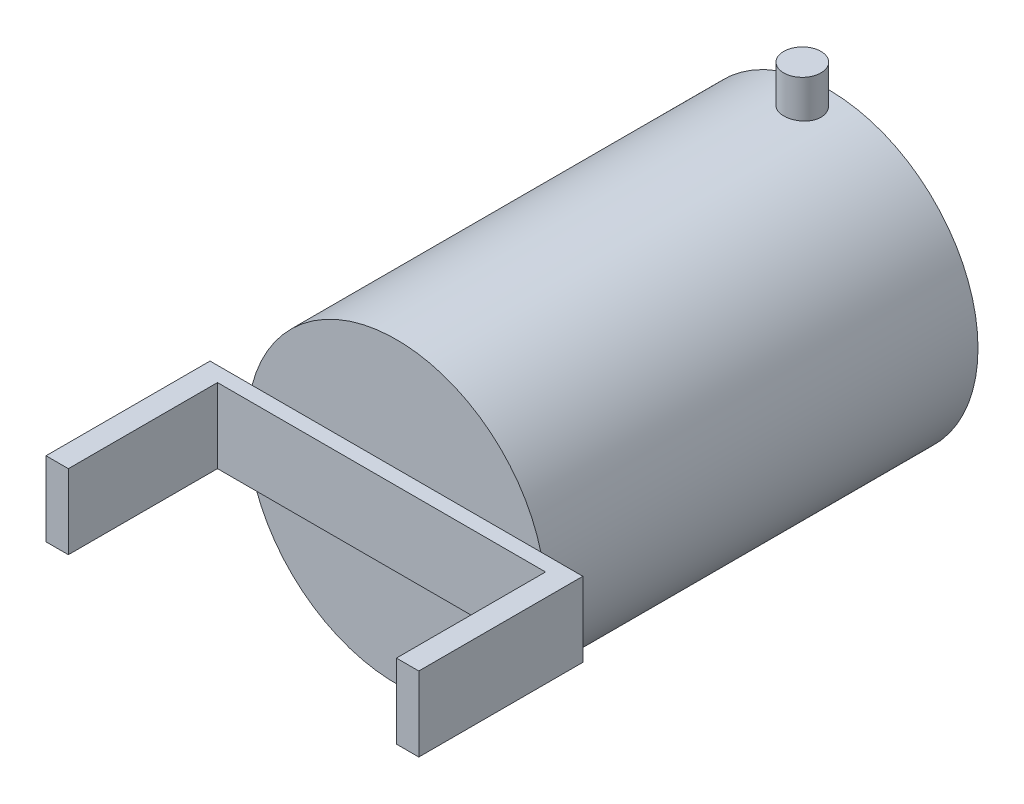
ISO-10303-21;
HEADER;
FILE_DESCRIPTION(('STEP AP214'),'2;1');
FILE_NAME('part.step','',(''),(''),'','','');
FILE_SCHEMA(('AUTOMOTIVE_DESIGN { 1 0 10303 214 1 1 1 1 }'));
ENDSEC;
DATA;
#1=APPLICATION_CONTEXT('core data for automotive mechanical design processes');
#2=APPLICATION_PROTOCOL_DEFINITION('international standard','automotive_design',2000,#1);
#3=PRODUCT_CONTEXT('',#1,'mechanical');
#4=PRODUCT('Part','Part','',(#3));
#5=PRODUCT_RELATED_PRODUCT_CATEGORY('part','',(#4));
#6=PRODUCT_DEFINITION_FORMATION('','',#4);
#7=PRODUCT_DEFINITION_CONTEXT('part definition',#1,'design');
#8=PRODUCT_DEFINITION('design','',#6,#7);
#9=PRODUCT_DEFINITION_SHAPE('','',#8);
#10=(LENGTH_UNIT() NAMED_UNIT(*) SI_UNIT(.MILLI.,.METRE.));
#11=(NAMED_UNIT(*) PLANE_ANGLE_UNIT() SI_UNIT($,.RADIAN.));
#12=(NAMED_UNIT(*) SI_UNIT($,.STERADIAN.) SOLID_ANGLE_UNIT());
#13=UNCERTAINTY_MEASURE_WITH_UNIT(LENGTH_MEASURE(1.E-05),#10,'distance_accuracy_value','');
#14=(GEOMETRIC_REPRESENTATION_CONTEXT(3) GLOBAL_UNCERTAINTY_ASSIGNED_CONTEXT((#13)) GLOBAL_UNIT_ASSIGNED_CONTEXT((#10,
#11,#12)) REPRESENTATION_CONTEXT('',''));
#15=CARTESIAN_POINT('',(0.,0.,0.));
#16=DIRECTION('',(0.,0.,1.));
#17=DIRECTION('',(1.,0.,0.));
#18=AXIS2_PLACEMENT_3D('',#15,#16,#17);
#19=CARTESIAN_POINT('',(0.,0.,60.));
#20=DIRECTION('',(0.,0.,1.));
#21=DIRECTION('',(1.,0.,0.));
#22=AXIS2_PLACEMENT_3D('',#19,#20,#21);
#23=PLANE('',#22);
#24=DIRECTION('',(1.,0.,0.));
#25=VECTOR('',#24,1.);
#26=CARTESIAN_POINT('',(-25.,-5.,60.));
#27=LINE('',#26,#25);
#28=CARTESIAN_POINT('',(-22.,-5.,60.));
#29=VERTEX_POINT('',#28);
#30=CARTESIAN_POINT('',(22.,-5.,60.));
#31=VERTEX_POINT('',#30);
#32=EDGE_CURVE('E882',#29,#31,#27,.T.);
#33=ORIENTED_EDGE('',*,*,#32,.T.);
#34=DIRECTION('',(0.,-1.,0.));
#35=VECTOR('',#34,1.);
#36=CARTESIAN_POINT('',(22.,5.,60.));
#37=LINE('',#36,#35);
#38=CARTESIAN_POINT('',(22.,5.,60.));
#39=VERTEX_POINT('',#38);
#40=EDGE_CURVE('E877',#39,#31,#37,.T.);
#41=ORIENTED_EDGE('',*,*,#40,.F.);
#42=DIRECTION('',(-1.,0.,0.));
#43=VECTOR('',#42,1.);
#44=CARTESIAN_POINT('',(-25.,5.,60.));
#45=LINE('',#44,#43);
#46=CARTESIAN_POINT('',(-22.,5.,60.));
#47=VERTEX_POINT('',#46);
#48=EDGE_CURVE('E994',#39,#47,#45,.T.);
#49=ORIENTED_EDGE('',*,*,#48,.T.);
#50=DIRECTION('',(0.,1.,0.));
#51=VECTOR('',#50,1.);
#52=CARTESIAN_POINT('',(-22.,5.,60.));
#53=LINE('',#52,#51);
#54=EDGE_CURVE('E975',#29,#47,#53,.T.);
#55=ORIENTED_EDGE('',*,*,#54,.F.);
#56=EDGE_LOOP('',(#33,#41,#49,#55));
#57=FACE_BOUND('',#56,.T.);
#58=ADVANCED_FACE('F853',(#57),#23,.T.);
#59=CARTESIAN_POINT('',(0.,0.,58.));
#60=DIRECTION('',(0.,0.,1.));
#61=DIRECTION('',(1.,0.,0.));
#62=AXIS2_PLACEMENT_3D('',#59,#60,#61);
#63=PLANE('',#62);
#64=DIRECTION('',(1.,0.,0.));
#65=VECTOR('',#64,1.);
#66=CARTESIAN_POINT('',(-25.,-5.,58.));
#67=LINE('',#66,#65);
#68=CARTESIAN_POINT('',(-19.3649167310371,-5.,58.));
#69=VERTEX_POINT('',#68);
#70=CARTESIAN_POINT('',(19.3649167310371,-5.,58.));
#71=VERTEX_POINT('',#70);
#72=EDGE_CURVE('E12',#69,#71,#67,.T.);
#73=ORIENTED_EDGE('',*,*,#72,.F.);
#74=CARTESIAN_POINT('',(0.,0.,58.));
#75=DIRECTION('',(0.,0.,1.));
#76=DIRECTION('',(1.,0.,0.));
#77=AXIS2_PLACEMENT_3D('',#74,#75,#76);
#78=CIRCLE('',#77,20.);
#79=EDGE_CURVE('E1079',#69,#71,#78,.T.);
#80=ORIENTED_EDGE('',*,*,#79,.T.);
#81=EDGE_LOOP('',(#73,#80));
#82=FACE_BOUND('',#81,.T.);
#83=ADVANCED_FACE('F1037',(#82),#63,.T.);
#84=CARTESIAN_POINT('',(0.,0.,58.));
#85=DIRECTION('',(0.,0.,-1.));
#86=DIRECTION('',(-1.,0.,0.));
#87=AXIS2_PLACEMENT_3D('',#84,#85,#86);
#88=CYLINDRICAL_SURFACE('',#87,20.);
#89=CARTESIAN_POINT('',(0.,-20.,6.06168620696042));
#90=CARTESIAN_POINT('',(0.139841095555761,-19.9999980489643,6.0616802660247));
#91=CARTESIAN_POINT('',(0.279769574302747,-19.998517845549,6.04991332779113));
#92=CARTESIAN_POINT('',(0.555732802089753,-19.9927554011136,6.00315845238962));
#93=CARTESIAN_POINT('',(0.691763330623745,-19.9884702344143,5.96814626903703));
#94=CARTESIAN_POINT('',(0.955895574813054,-19.9775806104441,5.87594856304633));
#95=CARTESIAN_POINT('',(1.08400256014614,-19.9709777145554,5.81877796515056));
#96=CARTESIAN_POINT('',(1.32877947489304,-19.956187008781,5.68391892299063));
#97=CARTESIAN_POINT('',(1.44545136155637,-19.9479994708412,5.6062339984297));
#98=CARTESIAN_POINT('',(1.66471281693132,-19.9309032130633,5.43209425712083));
#99=CARTESIAN_POINT('',(1.76723036493713,-19.9219911469242,5.33554907761418));
#100=CARTESIAN_POINT('',(1.95465279355749,-19.9044772600975,5.12662338342378));
#101=CARTESIAN_POINT('',(2.03955677639225,-19.8958754552427,5.01424206204717));
#102=CARTESIAN_POINT('',(2.18961016128394,-19.8799230561958,4.77636622939475));
#103=CARTESIAN_POINT('',(2.25469209594107,-19.8725767717791,4.65082884539248));
#104=CARTESIAN_POINT('',(2.36282307657512,-19.8600112845768,4.39049915501306));
#105=CARTESIAN_POINT('',(2.40587295806522,-19.8547920011314,4.25570719981341));
#106=CARTESIAN_POINT('',(2.46849898002476,-19.8471033960361,3.98144201137365));
#107=CARTESIAN_POINT('',(2.4881967147317,-19.8446198343674,3.84199694925622));
#108=CARTESIAN_POINT('',(2.50393554955723,-19.8426402814279,3.56175994348858));
#109=CARTESIAN_POINT('',(2.49997760100242,-19.8431441700151,3.42096805422913));
#110=CARTESIAN_POINT('',(2.4686172364479,-19.8470695536975,3.14288137971164));
#111=CARTESIAN_POINT('',(2.4413487629847,-19.8504743796033,3.00557122076015));
#112=CARTESIAN_POINT('',(2.36435038318205,-19.8597919975763,2.73749118574143));
#113=CARTESIAN_POINT('',(2.3146200217519,-19.8657048404572,2.60672144224638));
#114=CARTESIAN_POINT('',(2.19396555991165,-19.8793911586465,2.35501820793873));
#115=CARTESIAN_POINT('',(2.12298325370764,-19.8871697321144,2.23411290671143));
#116=CARTESIAN_POINT('',(1.96188146945692,-19.903707114306,2.00587951254717));
#117=CARTESIAN_POINT('',(1.87176111608078,-19.9124659678566,1.89855204098674));
#118=CARTESIAN_POINT('',(1.67419911075378,-19.9300510989042,1.69974349623768));
#119=CARTESIAN_POINT('',(1.56664200784001,-19.9388774238689,1.60837711519444));
#120=CARTESIAN_POINT('',(1.33765716911392,-19.9555463255585,1.44497732692987));
#121=CARTESIAN_POINT('',(1.21622940131825,-19.9633889000151,1.37294396428842));
#122=CARTESIAN_POINT('',(0.962861671363482,-19.9772115221858,1.2502548864965));
#123=CARTESIAN_POINT('',(0.830918195337718,-19.9831909440154,1.19960635307919));
#124=CARTESIAN_POINT('',(0.560307940431057,-19.9926078578006,1.12121571343716));
#125=CARTESIAN_POINT('',(0.421641476630668,-19.9960454687587,1.09347253482337));
#126=CARTESIAN_POINT('',(0.142513163913497,-19.9999759641076,1.06182878269987));
#127=CARTESIAN_POINT('',(0.00206949019860704,-20.0004883614264,1.05777021459635));
#128=CARTESIAN_POINT('',(-0.277496036497496,-19.9985633800543,1.07319394101637));
#129=CARTESIAN_POINT('',(-0.416617917564706,-19.9961260641821,1.09267573421201));
#130=CARTESIAN_POINT('',(-0.689124507721522,-19.9885876875669,1.1544959157348));
#131=CARTESIAN_POINT('',(-0.822526570424705,-19.9834954081387,1.19675897036305));
#132=CARTESIAN_POINT('',(-1.08034965485841,-19.971217231002,1.30286365887334));
#133=CARTESIAN_POINT('',(-1.20477037146531,-19.9640312622062,1.36670602545184));
#134=CARTESIAN_POINT('',(-1.44180452068743,-19.9483182291011,1.51453934446788));
#135=CARTESIAN_POINT('',(-1.55435375994382,-19.9397844404251,1.59863249676605));
#136=CARTESIAN_POINT('',(-1.76379698962632,-19.9223514232566,1.78443570449462));
#137=CARTESIAN_POINT('',(-1.86069035833686,-19.913452180269,1.88614645921141));
#138=CARTESIAN_POINT('',(-2.03663195881802,-19.8962310546258,2.10499362371756));
#139=CARTESIAN_POINT('',(-2.11557546056793,-19.8879127472133,2.22221455327081));
#140=CARTESIAN_POINT('',(-2.25265288944351,-19.8728541103715,2.46834445181513));
#141=CARTESIAN_POINT('',(-2.31078723372837,-19.8661137493103,2.59725318643694));
#142=CARTESIAN_POINT('',(-2.40442657886654,-19.85499850393,2.86276152610803));
#143=CARTESIAN_POINT('',(-2.43999062745711,-19.8506174518479,2.99934003700839));
#144=CARTESIAN_POINT('',(-2.48766999386785,-19.8446991590745,3.27658869074108));
#145=CARTESIAN_POINT('',(-2.49978640253576,-19.8431617860878,3.41725864291942));
#146=CARTESIAN_POINT('',(-2.50020653608484,-19.8431087698246,3.6976551361651));
#147=CARTESIAN_POINT('',(-2.48867479769927,-19.8445722475195,3.83738145529231));
#148=CARTESIAN_POINT('',(-2.44247440484933,-19.850311145372,4.1128933363055));
#149=CARTESIAN_POINT('',(-2.40780574790577,-19.8545865658308,4.24867889776921));
#150=CARTESIAN_POINT('',(-2.31636707368966,-19.8654611577455,4.51243316372682));
#151=CARTESIAN_POINT('',(-2.25960498097093,-19.8720594959278,4.64040465198223));
#152=CARTESIAN_POINT('',(-2.12560690215031,-19.8868378324482,4.88503286100873));
#153=CARTESIAN_POINT('',(-2.04837065950959,-19.8950178506041,5.00168943998025));
#154=CARTESIAN_POINT('',(-1.87500633126584,-19.9121060475223,5.22121743230089));
#155=CARTESIAN_POINT('',(-1.77875562577496,-19.9210187208403,5.3239916679154));
#156=CARTESIAN_POINT('',(-1.57035022696838,-19.938528315929,5.51199303212839));
#157=CARTESIAN_POINT('',(-1.45819178914157,-19.9471251627559,5.59721601773473));
#158=CARTESIAN_POINT('',(-1.22066562085421,-19.9630705658675,5.74797156406571));
#159=CARTESIAN_POINT('',(-1.09524927959617,-19.970414250783,5.81342801285967));
#160=CARTESIAN_POINT('',(-0.83518290230128,-19.9829764907672,5.9222574498767));
#161=CARTESIAN_POINT('',(-0.700543080870236,-19.9881973536958,5.96565443331388));
#162=CARTESIAN_POINT('',(-0.471005771967925,-19.9946672032775,6.01874554513172));
#163=CARTESIAN_POINT('',(-0.377555663516922,-19.9966572589545,6.03482514894248));
#164=CARTESIAN_POINT('',(-0.189417063212436,-19.9993243132919,6.05629745265364));
#165=CARTESIAN_POINT('',(-0.0947285804960277,-20.0000013216347,6.06169023135972));
#166=CARTESIAN_POINT('',(0.,-20.,6.06168620696042));
#167=B_SPLINE_CURVE_WITH_KNOTS('',3,(#89,#90,#91,#92,#93,#94,#95,#96,#97,#98,#99,#100,#101,#102,
#103,#104,#105,#106,#107,#108,#109,#110,#111,#112,#113,#114,#115,#116,#117,#118,#119,#120,#121,
#122,#123,#124,#125,#126,#127,#128,#129,#130,#131,#132,#133,#134,#135,#136,#137,#138,#139,#140,
#141,#142,#143,#144,#145,#146,#147,#148,#149,#150,#151,#152,#153,#154,#155,#156,#157,#158,#159,
#160,#161,#162,#163,#164,#165,#166),.UNSPECIFIED.,.T.,.F.,(4,2,2,2,2,2,2,2,2,2,2,2,2,2,2,2,2,2,
2,2,2,2,2,2,2,2,2,2,2,2,2,2,2,2,2,2,2,2,4),(0.,0.419177272776247,0.838792460943427,
1.25812550818177,1.67738665591073,2.09870813201843,2.52005107800011,2.94281250318869,
3.36555789496807,3.78609225286321,4.20660969884664,4.62472696441692,5.04285270166241,
5.46213426285534,5.88143500513639,6.30363478136417,6.72583553113114,7.14817795731605,
7.57050060903781,7.99000279391922,8.40949604501929,8.82761053893396,9.24573923078948,
9.66602402928423,10.0863255137509,10.5090197150757,10.9317054422154,11.3532807428093,
11.7748364301062,12.1934690120222,12.6121016387955,13.0305842470649,13.4490720991226,
13.8703523769183,14.2917319847001,14.7147140303685,15.1372349868403,15.4211884318763,
15.7051397830044),.UNSPECIFIED.);
#168=CARTESIAN_POINT('',(0.,-20.,6.06168620696042));
#169=VERTEX_POINT('',#168);
#170=EDGE_CURVE('E858',#169,#169,#167,.T.);
#171=ORIENTED_EDGE('',*,*,#170,.T.);
#172=EDGE_LOOP('',(#171));
#173=FACE_BOUND('',#172,.T.);
#174=CARTESIAN_POINT('',(19.3649167310371,5.,58.));
#175=VERTEX_POINT('',#174);
#176=CARTESIAN_POINT('',(-19.3649167310371,5.,58.));
#177=VERTEX_POINT('',#176);
#178=EDGE_CURVE('E1014',#175,#177,#78,.T.);
#179=ORIENTED_EDGE('',*,*,#178,.F.);
#180=EDGE_CURVE('E1018',#71,#175,#78,.T.);
#181=ORIENTED_EDGE('',*,*,#180,.F.);
#182=ORIENTED_EDGE('',*,*,#79,.F.);
#183=EDGE_CURVE('E1017',#177,#69,#78,.T.);
#184=ORIENTED_EDGE('',*,*,#183,.F.);
#185=EDGE_LOOP('',(#179,#181,#182,#184));
#186=FACE_BOUND('',#185,.T.);
#187=CARTESIAN_POINT('',(0.,0.,0.));
#188=DIRECTION('',(0.,0.,1.));
#189=DIRECTION('',(1.,0.,0.));
#190=AXIS2_PLACEMENT_3D('',#187,#188,#189);
#191=CIRCLE('',#190,20.);
#192=CARTESIAN_POINT('',(20.,0.,0.));
#193=VERTEX_POINT('',#192);
#194=EDGE_CURVE('E1013',#193,#193,#191,.T.);
#195=ORIENTED_EDGE('',*,*,#194,.T.);
#196=EDGE_LOOP('',(#195));
#197=FACE_BOUND('',#196,.T.);
#198=CARTESIAN_POINT('',(0.,20.,1.06168620696042));
#199=CARTESIAN_POINT('',(-0.139841095555761,19.9999980489643,1.06169214789614));
#200=CARTESIAN_POINT('',(-0.279769574302747,19.998517845549,1.0734590861297));
#201=CARTESIAN_POINT('',(-0.555732802089753,19.9927554011136,1.12021396153121));
#202=CARTESIAN_POINT('',(-0.691763330623745,19.9884702344143,1.15522614488381));
#203=CARTESIAN_POINT('',(-0.955895574813054,19.9775806104441,1.2474238508745));
#204=CARTESIAN_POINT('',(-1.08400256014614,19.9709777145554,1.30459444877027));
#205=CARTESIAN_POINT('',(-1.32877947489304,19.956187008781,1.43945349093021));
#206=CARTESIAN_POINT('',(-1.44545136155637,19.9479994708412,1.51713841549113));
#207=CARTESIAN_POINT('',(-1.66471281693132,19.9309032130633,1.69127815680001));
#208=CARTESIAN_POINT('',(-1.76723036493713,19.9219911469242,1.78782333630666));
#209=CARTESIAN_POINT('',(-1.95465279355749,19.9044772600975,1.99674903049706));
#210=CARTESIAN_POINT('',(-2.03955677639225,19.8958754552427,2.10913035187366));
#211=CARTESIAN_POINT('',(-2.18961016128394,19.8799230561958,2.34700618452608));
#212=CARTESIAN_POINT('',(-2.25469209594107,19.8725767717791,2.47254356852836));
#213=CARTESIAN_POINT('',(-2.36282307657512,19.8600112845768,2.73287325890778));
#214=CARTESIAN_POINT('',(-2.40587295806522,19.8547920011314,2.86766521410743));
#215=CARTESIAN_POINT('',(-2.46849898002476,19.8471033960361,3.14193040254718));
#216=CARTESIAN_POINT('',(-2.4881967147317,19.8446198343674,3.28137546466461));
#217=CARTESIAN_POINT('',(-2.50393554955723,19.8426402814279,3.56161247043225));
#218=CARTESIAN_POINT('',(-2.49997760100242,19.8431441700151,3.70240435969171));
#219=CARTESIAN_POINT('',(-2.4686172364479,19.8470695536975,3.9804910342092));
#220=CARTESIAN_POINT('',(-2.4413487629847,19.8504743796033,4.11780119316068));
#221=CARTESIAN_POINT('',(-2.36435038318205,19.8597919975763,4.3858812281794));
#222=CARTESIAN_POINT('',(-2.3146200217519,19.8657048404572,4.51665097167446));
#223=CARTESIAN_POINT('',(-2.19396555991165,19.8793911586465,4.7683542059821));
#224=CARTESIAN_POINT('',(-2.12298325370764,19.8871697321144,4.8892595072094));
#225=CARTESIAN_POINT('',(-1.96188146945692,19.903707114306,5.11749290137366));
#226=CARTESIAN_POINT('',(-1.87176111608078,19.9124659678566,5.2248203729341));
#227=CARTESIAN_POINT('',(-1.67419911075378,19.9300510989042,5.42362891768316));
#228=CARTESIAN_POINT('',(-1.56664200784001,19.9388774238689,5.5149952987264));
#229=CARTESIAN_POINT('',(-1.33765716911392,19.9555463255585,5.67839508699097));
#230=CARTESIAN_POINT('',(-1.21622940131825,19.9633889000151,5.75042844963242));
#231=CARTESIAN_POINT('',(-0.962861671363482,19.9772115221858,5.87311752742433));
#232=CARTESIAN_POINT('',(-0.830918195337717,19.9831909440154,5.92376606084165));
#233=CARTESIAN_POINT('',(-0.560307940431056,19.9926078578006,6.00215670048367));
#234=CARTESIAN_POINT('',(-0.421641476630667,19.9960454687587,6.02989987909747));
#235=CARTESIAN_POINT('',(-0.142513163913497,19.9999759641076,6.06154363122097));
#236=CARTESIAN_POINT('',(-0.00206949019860737,20.0004883614264,6.06560219932449));
#237=CARTESIAN_POINT('',(0.277496036497496,19.9985633800543,6.05017847290447));
#238=CARTESIAN_POINT('',(0.416617917564706,19.9961260641821,6.03069667970883));
#239=CARTESIAN_POINT('',(0.689124507721521,19.9885876875669,5.96887649818603));
#240=CARTESIAN_POINT('',(0.822526570424704,19.9834954081387,5.92661344355778));
#241=CARTESIAN_POINT('',(1.08034965485841,19.971217231002,5.8205087550475));
#242=CARTESIAN_POINT('',(1.20477037146531,19.9640312622062,5.75666638846899));
#243=CARTESIAN_POINT('',(1.44180452068743,19.9483182291011,5.60883306945296));
#244=CARTESIAN_POINT('',(1.55435375994382,19.9397844404251,5.52473991715478));
#245=CARTESIAN_POINT('',(1.76379698962632,19.9223514232566,5.33893670942622));
#246=CARTESIAN_POINT('',(1.86069035833686,19.913452180269,5.23722595470943));
#247=CARTESIAN_POINT('',(2.03663195881802,19.8962310546258,5.01837879020328));
#248=CARTESIAN_POINT('',(2.11557546056793,19.8879127472133,4.90115786065002));
#249=CARTESIAN_POINT('',(2.2526528894435,19.8728541103715,4.65502796210571));
#250=CARTESIAN_POINT('',(2.31078723372837,19.8661137493103,4.5261192274839));
#251=CARTESIAN_POINT('',(2.40442657886654,19.85499850393,4.26061088781281));
#252=CARTESIAN_POINT('',(2.43999062745711,19.8506174518479,4.12403237691245));
#253=CARTESIAN_POINT('',(2.48766999386785,19.8446991590745,3.84678372317975));
#254=CARTESIAN_POINT('',(2.49978640253576,19.8431617860878,3.70611377100142));
#255=CARTESIAN_POINT('',(2.50020653608484,19.8431087698246,3.42571727775574));
#256=CARTESIAN_POINT('',(2.48867479769927,19.8445722475195,3.28599095862853));
#257=CARTESIAN_POINT('',(2.44247440484933,19.850311145372,3.01047907761534));
#258=CARTESIAN_POINT('',(2.40780574790577,19.8545865658308,2.87469351615162));
#259=CARTESIAN_POINT('',(2.31636707368966,19.8654611577455,2.61093925019402));
#260=CARTESIAN_POINT('',(2.25960498097093,19.8720594959278,2.4829677619386));
#261=CARTESIAN_POINT('',(2.12560690215031,19.8868378324482,2.2383395529121));
#262=CARTESIAN_POINT('',(2.04837065950959,19.8950178506041,2.12168297394059));
#263=CARTESIAN_POINT('',(1.87500633126584,19.9121060475223,1.90215498161994));
#264=CARTESIAN_POINT('',(1.77875562577496,19.9210187208403,1.79938074600544));
#265=CARTESIAN_POINT('',(1.57035022696838,19.938528315929,1.61137938179244));
#266=CARTESIAN_POINT('',(1.45819178914157,19.9471251627559,1.52615639618611));
#267=CARTESIAN_POINT('',(1.22066562085421,19.9630705658675,1.37540084985512));
#268=CARTESIAN_POINT('',(1.09524927959617,19.970414250783,1.30994440106116));
#269=CARTESIAN_POINT('',(0.835182902301281,19.9829764907672,1.20111496404414));
#270=CARTESIAN_POINT('',(0.700543080870236,19.9881973536958,1.15771798060696));
#271=CARTESIAN_POINT('',(0.471005771967925,19.9946672032775,1.10462686878911));
#272=CARTESIAN_POINT('',(0.377555663516921,19.9966572589545,1.08854726497835));
#273=CARTESIAN_POINT('',(0.189417063212435,19.9993243132919,1.06707496126719));
#274=CARTESIAN_POINT('',(0.0947285804960273,20.0000013216347,1.06168218256112));
#275=CARTESIAN_POINT('',(0.,20.,1.06168620696042));
#276=B_SPLINE_CURVE_WITH_KNOTS('',3,(#198,#199,#200,#201,#202,#203,#204,#205,#206,#207,#208,
#209,#210,#211,#212,#213,#214,#215,#216,#217,#218,#219,#220,#221,#222,#223,#224,#225,#226,#227,
#228,#229,#230,#231,#232,#233,#234,#235,#236,#237,#238,#239,#240,#241,#242,#243,#244,#245,#246,
#247,#248,#249,#250,#251,#252,#253,#254,#255,#256,#257,#258,#259,#260,#261,#262,#263,#264,#265,
#266,#267,#268,#269,#270,#271,#272,#273,#274,#275),.UNSPECIFIED.,.T.,.F.,(4,2,2,2,2,2,2,2,2,2,2,
2,2,2,2,2,2,2,2,2,2,2,2,2,2,2,2,2,2,2,2,2,2,2,2,2,2,2,4),(0.,0.419177272776247,
0.838792460943427,1.25812550818177,1.67738665591073,2.09870813201843,2.52005107800011,
2.94281250318869,3.36555789496807,3.78609225286321,4.20660969884664,4.62472696441692,
5.04285270166241,5.46213426285534,5.88143500513639,6.30363478136417,6.72583553113114,
7.14817795731605,7.5705006090378,7.99000279391921,8.40949604501929,8.82761053893396,
9.24573923078948,9.66602402928422,10.0863255137509,10.5090197150757,10.9317054422154,
11.3532807428093,11.7748364301062,12.1934690120222,12.6121016387955,13.0305842470649,
13.4490720991226,13.8703523769183,14.2917319847001,14.7147140303685,15.1372349868403,
15.4211884318763,15.7051397830044),.UNSPECIFIED.);
#277=CARTESIAN_POINT('',(0.,20.,1.06168620696042));
#278=VERTEX_POINT('',#277);
#279=EDGE_CURVE('E1016',#278,#278,#276,.T.);
#280=ORIENTED_EDGE('',*,*,#279,.F.);
#281=EDGE_LOOP('',(#280));
#282=FACE_BOUND('',#281,.T.);
#283=ADVANCED_FACE('F855',(#173,#186,#197,#282),#88,.T.);
#284=DIRECTION('',(-1.,0.,0.));
#285=VECTOR('',#284,1.);
#286=CARTESIAN_POINT('',(-25.,5.,58.));
#287=LINE('',#286,#285);
#288=EDGE_CURVE('E867',#175,#177,#287,.T.);
#289=ORIENTED_EDGE('',*,*,#288,.F.);
#290=ORIENTED_EDGE('',*,*,#178,.T.);
#291=EDGE_LOOP('',(#289,#290));
#292=FACE_BOUND('',#291,.T.);
#293=ADVANCED_FACE('F1034',(#292),#63,.T.);
#294=CARTESIAN_POINT('',(0.,0.,0.));
#295=DIRECTION('',(0.,0.,1.));
#296=DIRECTION('',(1.,0.,0.));
#297=AXIS2_PLACEMENT_3D('',#294,#295,#296);
#298=PLANE('',#297);
#299=ORIENTED_EDGE('',*,*,#194,.F.);
#300=EDGE_LOOP('',(#299));
#301=FACE_BOUND('',#300,.T.);
#302=ADVANCED_FACE('F1031',(#301),#298,.F.);
#303=CARTESIAN_POINT('',(0.,25.,3.56168620696042));
#304=DIRECTION('',(0.,-1.,0.));
#305=DIRECTION('',(0.,0.,-1.));
#306=AXIS2_PLACEMENT_3D('',#303,#304,#305);
#307=CYLINDRICAL_SURFACE('',#306,2.5);
#308=CARTESIAN_POINT('',(0.,25.,3.56168620696042));
#309=DIRECTION('',(0.,1.,0.));
#310=DIRECTION('',(0.,0.,1.));
#311=AXIS2_PLACEMENT_3D('',#308,#309,#310);
#312=CIRCLE('',#311,2.5);
#313=CARTESIAN_POINT('',(0.,25.,6.06168620696042));
#314=VERTEX_POINT('',#313);
#315=EDGE_CURVE('E948',#314,#314,#312,.T.);
#316=ORIENTED_EDGE('',*,*,#315,.F.);
#317=EDGE_LOOP('',(#316));
#318=FACE_BOUND('',#317,.T.);
#319=ORIENTED_EDGE('',*,*,#279,.T.);
#320=EDGE_LOOP('',(#319));
#321=FACE_BOUND('',#320,.T.);
#322=ADVANCED_FACE('F1025',(#318,#321),#307,.T.);
#323=CARTESIAN_POINT('',(0.,25.,3.56168620696042));
#324=DIRECTION('',(0.,1.,0.));
#325=DIRECTION('',(0.,0.,1.));
#326=AXIS2_PLACEMENT_3D('',#323,#324,#325);
#327=PLANE('',#326);
#328=ORIENTED_EDGE('',*,*,#315,.T.);
#329=EDGE_LOOP('',(#328));
#330=FACE_BOUND('',#329,.T.);
#331=ADVANCED_FACE('F1030',(#330),#327,.T.);
#332=CARTESIAN_POINT('',(0.,0.,58.));
#333=DIRECTION('',(0.,0.,1.));
#334=DIRECTION('',(1.,0.,0.));
#335=AXIS2_PLACEMENT_3D('',#332,#333,#334);
#336=PLANE('',#335);
#337=CARTESIAN_POINT('',(-25.,5.,58.));
#338=VERTEX_POINT('',#337);
#339=EDGE_CURVE('E999',#177,#338,#287,.T.);
#340=ORIENTED_EDGE('',*,*,#339,.F.);
#341=ORIENTED_EDGE('',*,*,#183,.T.);
#342=CARTESIAN_POINT('',(-25.,-5.,58.));
#343=VERTEX_POINT('',#342);
#344=EDGE_CURVE('E869',#343,#69,#67,.T.);
#345=ORIENTED_EDGE('',*,*,#344,.F.);
#346=DIRECTION('',(0.,-1.,0.));
#347=VECTOR('',#346,1.);
#348=CARTESIAN_POINT('',(-25.,5.,58.));
#349=LINE('',#348,#347);
#350=EDGE_CURVE('E1002',#338,#343,#349,.T.);
#351=ORIENTED_EDGE('',*,*,#350,.F.);
#352=EDGE_LOOP('',(#340,#341,#345,#351));
#353=FACE_BOUND('',#352,.T.);
#354=ADVANCED_FACE('F1053',(#353),#336,.F.);
#355=CARTESIAN_POINT('',(25.,-5.,58.));
#356=VERTEX_POINT('',#355);
#357=EDGE_CURVE('E870',#71,#356,#67,.T.);
#358=ORIENTED_EDGE('',*,*,#357,.F.);
#359=ORIENTED_EDGE('',*,*,#180,.T.);
#360=CARTESIAN_POINT('',(25.,5.,58.));
#361=VERTEX_POINT('',#360);
#362=EDGE_CURVE('E1000',#361,#175,#287,.T.);
#363=ORIENTED_EDGE('',*,*,#362,.F.);
#364=DIRECTION('',(0.,1.,0.));
#365=VECTOR('',#364,1.);
#366=CARTESIAN_POINT('',(25.,5.,58.));
#367=LINE('',#366,#365);
#368=EDGE_CURVE('E945',#356,#361,#367,.T.);
#369=ORIENTED_EDGE('',*,*,#368,.F.);
#370=EDGE_LOOP('',(#358,#359,#363,#369));
#371=FACE_BOUND('',#370,.T.);
#372=ADVANCED_FACE('F1056',(#371),#336,.F.);
#373=CARTESIAN_POINT('',(25.,5.,60.));
#374=DIRECTION('',(-1.,0.,0.));
#375=DIRECTION('',(0.,0.,1.));
#376=AXIS2_PLACEMENT_3D('',#373,#374,#375);
#377=PLANE('',#376);
#378=ORIENTED_EDGE('',*,*,#368,.T.);
#379=DIRECTION('',(0.,0.,-1.));
#380=VECTOR('',#379,1.);
#381=CARTESIAN_POINT('',(25.,5.,60.));
#382=LINE('',#381,#380);
#383=CARTESIAN_POINT('',(25.,5.,80.));
#384=VERTEX_POINT('',#383);
#385=EDGE_CURVE('E938',#384,#361,#382,.T.);
#386=ORIENTED_EDGE('',*,*,#385,.F.);
#387=DIRECTION('',(0.,1.,0.));
#388=VECTOR('',#387,1.);
#389=CARTESIAN_POINT('',(25.,5.,80.));
#390=LINE('',#389,#388);
#391=CARTESIAN_POINT('',(25.,-5.,80.));
#392=VERTEX_POINT('',#391);
#393=EDGE_CURVE('E943',#392,#384,#390,.T.);
#394=ORIENTED_EDGE('',*,*,#393,.F.);
#395=DIRECTION('',(0.,0.,-1.));
#396=VECTOR('',#395,1.);
#397=CARTESIAN_POINT('',(25.,-5.,60.));
#398=LINE('',#397,#396);
#399=EDGE_CURVE('E997',#392,#356,#398,.T.);
#400=ORIENTED_EDGE('',*,*,#399,.T.);
#401=EDGE_LOOP('',(#378,#386,#394,#400));
#402=FACE_BOUND('',#401,.T.);
#403=ADVANCED_FACE('F940',(#402),#377,.F.);
#404=CARTESIAN_POINT('',(-25.,5.,60.));
#405=DIRECTION('',(0.,-1.,0.));
#406=DIRECTION('',(0.,0.,-1.));
#407=AXIS2_PLACEMENT_3D('',#404,#405,#406);
#408=PLANE('',#407);
#409=ORIENTED_EDGE('',*,*,#362,.T.);
#410=ORIENTED_EDGE('',*,*,#288,.T.);
#411=ORIENTED_EDGE('',*,*,#339,.T.);
#412=DIRECTION('',(0.,0.,-1.));
#413=VECTOR('',#412,1.);
#414=CARTESIAN_POINT('',(-25.,5.,60.));
#415=LINE('',#414,#413);
#416=CARTESIAN_POINT('',(-25.,5.,80.));
#417=VERTEX_POINT('',#416);
#418=EDGE_CURVE('E949',#417,#338,#415,.T.);
#419=ORIENTED_EDGE('',*,*,#418,.F.);
#420=DIRECTION('',(-1.,0.,0.));
#421=VECTOR('',#420,1.);
#422=CARTESIAN_POINT('',(-25.,5.,80.));
#423=LINE('',#422,#421);
#424=CARTESIAN_POINT('',(-22.,5.,80.));
#425=VERTEX_POINT('',#424);
#426=EDGE_CURVE('E983',#425,#417,#423,.T.);
#427=ORIENTED_EDGE('',*,*,#426,.F.);
#428=DIRECTION('',(0.,0.,-1.));
#429=VECTOR('',#428,1.);
#430=CARTESIAN_POINT('',(-22.,5.,80.));
#431=LINE('',#430,#429);
#432=EDGE_CURVE('E986',#425,#47,#431,.T.);
#433=ORIENTED_EDGE('',*,*,#432,.T.);
#434=ORIENTED_EDGE('',*,*,#48,.F.);
#435=DIRECTION('',(0.,0.,-1.));
#436=VECTOR('',#435,1.);
#437=CARTESIAN_POINT('',(22.,5.,80.));
#438=LINE('',#437,#436);
#439=CARTESIAN_POINT('',(22.,5.,80.));
#440=VERTEX_POINT('',#439);
#441=EDGE_CURVE('E955',#440,#39,#438,.T.);
#442=ORIENTED_EDGE('',*,*,#441,.F.);
#443=DIRECTION('',(-1.,0.,0.));
#444=VECTOR('',#443,1.);
#445=CARTESIAN_POINT('',(25.,5.,80.));
#446=LINE('',#445,#444);
#447=EDGE_CURVE('E952',#384,#440,#446,.T.);
#448=ORIENTED_EDGE('',*,*,#447,.F.);
#449=ORIENTED_EDGE('',*,*,#385,.T.);
#450=EDGE_LOOP('',(#409,#410,#411,#419,#427,#433,#434,#442,#448,#449));
#451=FACE_BOUND('',#450,.T.);
#452=ADVANCED_FACE('F953',(#451),#408,.F.);
#453=CARTESIAN_POINT('',(-25.,5.,60.));
#454=DIRECTION('',(1.,0.,0.));
#455=DIRECTION('',(0.,0.,-1.));
#456=AXIS2_PLACEMENT_3D('',#453,#454,#455);
#457=PLANE('',#456);
#458=ORIENTED_EDGE('',*,*,#350,.T.);
#459=DIRECTION('',(0.,0.,-1.));
#460=VECTOR('',#459,1.);
#461=CARTESIAN_POINT('',(-25.,-5.,60.));
#462=LINE('',#461,#460);
#463=CARTESIAN_POINT('',(-25.,-5.,80.));
#464=VERTEX_POINT('',#463);
#465=EDGE_CURVE('E1006',#464,#343,#462,.T.);
#466=ORIENTED_EDGE('',*,*,#465,.F.);
#467=DIRECTION('',(0.,-1.,0.));
#468=VECTOR('',#467,1.);
#469=CARTESIAN_POINT('',(-25.,5.,80.));
#470=LINE('',#469,#468);
#471=EDGE_CURVE('E976',#417,#464,#470,.T.);
#472=ORIENTED_EDGE('',*,*,#471,.F.);
#473=ORIENTED_EDGE('',*,*,#418,.T.);
#474=EDGE_LOOP('',(#458,#466,#472,#473));
#475=FACE_BOUND('',#474,.T.);
#476=ADVANCED_FACE('F1061',(#475),#457,.F.);
#477=CARTESIAN_POINT('',(-25.,-5.,60.));
#478=DIRECTION('',(0.,1.,0.));
#479=DIRECTION('',(0.,0.,1.));
#480=AXIS2_PLACEMENT_3D('',#477,#478,#479);
#481=PLANE('',#480);
#482=ORIENTED_EDGE('',*,*,#344,.T.);
#483=ORIENTED_EDGE('',*,*,#72,.T.);
#484=ORIENTED_EDGE('',*,*,#357,.T.);
#485=ORIENTED_EDGE('',*,*,#399,.F.);
#486=DIRECTION('',(1.,0.,0.));
#487=VECTOR('',#486,1.);
#488=CARTESIAN_POINT('',(25.,-5.,80.));
#489=LINE('',#488,#487);
#490=CARTESIAN_POINT('',(22.,-5.,80.));
#491=VERTEX_POINT('',#490);
#492=EDGE_CURVE('E963',#491,#392,#489,.T.);
#493=ORIENTED_EDGE('',*,*,#492,.F.);
#494=DIRECTION('',(0.,0.,-1.));
#495=VECTOR('',#494,1.);
#496=CARTESIAN_POINT('',(22.,-5.,80.));
#497=LINE('',#496,#495);
#498=EDGE_CURVE('E970',#491,#31,#497,.T.);
#499=ORIENTED_EDGE('',*,*,#498,.T.);
#500=ORIENTED_EDGE('',*,*,#32,.F.);
#501=DIRECTION('',(0.,0.,-1.));
#502=VECTOR('',#501,1.);
#503=CARTESIAN_POINT('',(-22.,-5.,80.));
#504=LINE('',#503,#502);
#505=CARTESIAN_POINT('',(-22.,-5.,80.));
#506=VERTEX_POINT('',#505);
#507=EDGE_CURVE('E991',#506,#29,#504,.T.);
#508=ORIENTED_EDGE('',*,*,#507,.F.);
#509=DIRECTION('',(1.,0.,0.));
#510=VECTOR('',#509,1.);
#511=CARTESIAN_POINT('',(-25.,-5.,80.));
#512=LINE('',#511,#510);
#513=EDGE_CURVE('E979',#464,#506,#512,.T.);
#514=ORIENTED_EDGE('',*,*,#513,.F.);
#515=ORIENTED_EDGE('',*,*,#465,.T.);
#516=EDGE_LOOP('',(#482,#483,#484,#485,#493,#499,#500,#508,#514,#515));
#517=FACE_BOUND('',#516,.T.);
#518=ADVANCED_FACE('F1058',(#517),#481,.F.);
#519=CARTESIAN_POINT('',(-22.,5.,80.));
#520=DIRECTION('',(-1.,0.,0.));
#521=DIRECTION('',(0.,0.,1.));
#522=AXIS2_PLACEMENT_3D('',#519,#520,#521);
#523=PLANE('',#522);
#524=ORIENTED_EDGE('',*,*,#54,.T.);
#525=ORIENTED_EDGE('',*,*,#432,.F.);
#526=DIRECTION('',(0.,1.,0.));
#527=VECTOR('',#526,1.);
#528=CARTESIAN_POINT('',(-22.,5.,80.));
#529=LINE('',#528,#527);
#530=EDGE_CURVE('E981',#506,#425,#529,.T.);
#531=ORIENTED_EDGE('',*,*,#530,.F.);
#532=ORIENTED_EDGE('',*,*,#507,.T.);
#533=EDGE_LOOP('',(#524,#525,#531,#532));
#534=FACE_BOUND('',#533,.T.);
#535=ADVANCED_FACE('F1051',(#534),#523,.F.);
#536=CARTESIAN_POINT('',(0.,0.,80.));
#537=DIRECTION('',(0.,0.,1.));
#538=DIRECTION('',(1.,0.,0.));
#539=AXIS2_PLACEMENT_3D('',#536,#537,#538);
#540=PLANE('',#539);
#541=ORIENTED_EDGE('',*,*,#471,.T.);
#542=ORIENTED_EDGE('',*,*,#513,.T.);
#543=ORIENTED_EDGE('',*,*,#530,.T.);
#544=ORIENTED_EDGE('',*,*,#426,.T.);
#545=EDGE_LOOP('',(#541,#542,#543,#544));
#546=FACE_BOUND('',#545,.T.);
#547=ADVANCED_FACE('F1092',(#546),#540,.T.);
#548=CARTESIAN_POINT('',(22.,5.,80.));
#549=DIRECTION('',(1.,0.,0.));
#550=DIRECTION('',(0.,0.,-1.));
#551=AXIS2_PLACEMENT_3D('',#548,#549,#550);
#552=PLANE('',#551);
#553=ORIENTED_EDGE('',*,*,#40,.T.);
#554=ORIENTED_EDGE('',*,*,#498,.F.);
#555=DIRECTION('',(0.,-1.,0.));
#556=VECTOR('',#555,1.);
#557=CARTESIAN_POINT('',(22.,5.,80.));
#558=LINE('',#557,#556);
#559=EDGE_CURVE('E958',#440,#491,#558,.T.);
#560=ORIENTED_EDGE('',*,*,#559,.F.);
#561=ORIENTED_EDGE('',*,*,#441,.T.);
#562=EDGE_LOOP('',(#553,#554,#560,#561));
#563=FACE_BOUND('',#562,.T.);
#564=ADVANCED_FACE('F1099',(#563),#552,.F.);
#565=CARTESIAN_POINT('',(0.,0.,80.));
#566=DIRECTION('',(0.,0.,-1.));
#567=DIRECTION('',(-1.,0.,0.));
#568=AXIS2_PLACEMENT_3D('',#565,#566,#567);
#569=PLANE('',#568);
#570=ORIENTED_EDGE('',*,*,#393,.T.);
#571=ORIENTED_EDGE('',*,*,#447,.T.);
#572=ORIENTED_EDGE('',*,*,#559,.T.);
#573=ORIENTED_EDGE('',*,*,#492,.T.);
#574=EDGE_LOOP('',(#570,#571,#572,#573));
#575=FACE_BOUND('',#574,.T.);
#576=ADVANCED_FACE('F961',(#575),#569,.F.);
#577=CARTESIAN_POINT('',(0.,-25.,3.56168620696042));
#578=DIRECTION('',(0.,1.,0.));
#579=DIRECTION('',(0.,0.,1.));
#580=AXIS2_PLACEMENT_3D('',#577,#578,#579);
#581=CYLINDRICAL_SURFACE('',#580,2.5);
#582=CARTESIAN_POINT('',(0.,-25.,3.56168620696042));
#583=DIRECTION('',(0.,1.,0.));
#584=DIRECTION('',(0.,0.,1.));
#585=AXIS2_PLACEMENT_3D('',#582,#583,#584);
#586=CIRCLE('',#585,2.5);
#587=CARTESIAN_POINT('',(0.,-25.,6.06168620696042));
#588=VERTEX_POINT('',#587);
#589=EDGE_CURVE('E967',#588,#588,#586,.T.);
#590=ORIENTED_EDGE('',*,*,#589,.T.);
#591=EDGE_LOOP('',(#590));
#592=FACE_BOUND('',#591,.T.);
#593=ORIENTED_EDGE('',*,*,#170,.F.);
#594=EDGE_LOOP('',(#593));
#595=FACE_BOUND('',#594,.T.);
#596=ADVANCED_FACE('F1106',(#592,#595),#581,.T.);
#597=CARTESIAN_POINT('',(0.,-25.,3.56168620696042));
#598=DIRECTION('',(0.,-1.,0.));
#599=DIRECTION('',(0.,0.,1.));
#600=AXIS2_PLACEMENT_3D('',#597,#598,#599);
#601=PLANE('',#600);
#602=ORIENTED_EDGE('',*,*,#589,.F.);
#603=EDGE_LOOP('',(#602));
#604=FACE_BOUND('',#603,.T.);
#605=ADVANCED_FACE('F1111',(#604),#601,.T.);
#606=CLOSED_SHELL('',(#58,#83,#283,#293,#302,#322,#331,#354,#372,#403,#452,#476,#518,#535,#547,
#564,#576,#596,#605));
#607=MANIFOLD_SOLID_BREP('B2',#606);
#608=ADVANCED_BREP_SHAPE_REPRESENTATION('',(#18,#607),#14);
#609=SHAPE_DEFINITION_REPRESENTATION(#9,#608);
ENDSEC;
END-ISO-10303-21;
